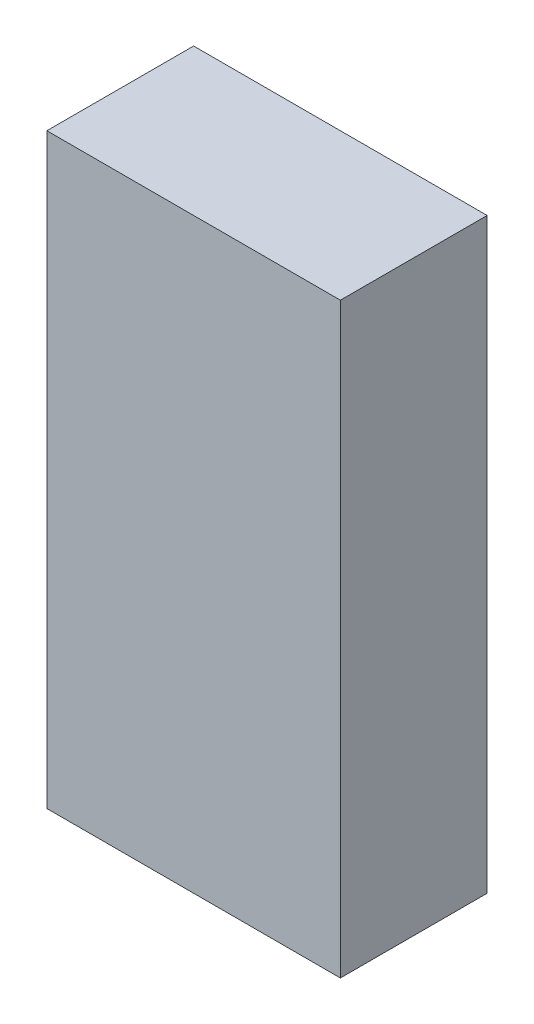
ISO-10303-21;
HEADER;
FILE_DESCRIPTION(('STEP AP214'),'2;1');
FILE_NAME('part.step','',(''),(''),'','','');
FILE_SCHEMA(('AUTOMOTIVE_DESIGN { 1 0 10303 214 1 1 1 1 }'));
ENDSEC;
DATA;
#1=APPLICATION_CONTEXT('core data for automotive mechanical design processes');
#2=APPLICATION_PROTOCOL_DEFINITION('international standard','automotive_design',2000,#1);
#3=PRODUCT_CONTEXT('',#1,'mechanical');
#4=PRODUCT('Part','Part','',(#3));
#5=PRODUCT_RELATED_PRODUCT_CATEGORY('part','',(#4));
#6=PRODUCT_DEFINITION_FORMATION('','',#4);
#7=PRODUCT_DEFINITION_CONTEXT('part definition',#1,'design');
#8=PRODUCT_DEFINITION('design','',#6,#7);
#9=PRODUCT_DEFINITION_SHAPE('','',#8);
#10=(LENGTH_UNIT() NAMED_UNIT(*) SI_UNIT(.MILLI.,.METRE.));
#11=(NAMED_UNIT(*) PLANE_ANGLE_UNIT() SI_UNIT($,.RADIAN.));
#12=(NAMED_UNIT(*) SI_UNIT($,.STERADIAN.) SOLID_ANGLE_UNIT());
#13=UNCERTAINTY_MEASURE_WITH_UNIT(LENGTH_MEASURE(1.E-05),#10,'distance_accuracy_value','');
#14=(GEOMETRIC_REPRESENTATION_CONTEXT(3) GLOBAL_UNCERTAINTY_ASSIGNED_CONTEXT((#13)) GLOBAL_UNIT_ASSIGNED_CONTEXT((#10,
#11,#12)) REPRESENTATION_CONTEXT('',''));
#15=CARTESIAN_POINT('',(0.,0.,0.));
#16=DIRECTION('',(0.,0.,1.));
#17=DIRECTION('',(1.,0.,0.));
#18=AXIS2_PLACEMENT_3D('',#15,#16,#17);
#19=CARTESIAN_POINT('',(0.50000154,-0.999998,0.499999));
#20=DIRECTION('',(0.,0.,-1.));
#21=DIRECTION('',(-1.,0.,0.));
#22=AXIS2_PLACEMENT_3D('',#19,#20,#21);
#23=PLANE('',#22);
#24=DIRECTION('',(1.,0.,0.));
#25=VECTOR('',#24,1.);
#26=CARTESIAN_POINT('',(0.50000154,1.00000054,0.499999));
#27=LINE('',#26,#25);
#28=CARTESIAN_POINT('',(0.50000154,1.00000054,0.499999));
#29=VERTEX_POINT('',#28);
#30=CARTESIAN_POINT('',(-0.499999,1.00000054,0.499999));
#31=VERTEX_POINT('',#30);
#32=EDGE_CURVE('E55',#29,#31,#27,.F.);
#33=ORIENTED_EDGE('',*,*,#32,.T.);
#34=DIRECTION('',(0.,1.,0.));
#35=VECTOR('',#34,1.);
#36=CARTESIAN_POINT('',(-0.499999,1.00000054,0.499999));
#37=LINE('',#36,#35);
#38=CARTESIAN_POINT('',(-0.499999,-0.999998,0.499999));
#39=VERTEX_POINT('',#38);
#40=EDGE_CURVE('E57',#31,#39,#37,.F.);
#41=ORIENTED_EDGE('',*,*,#40,.T.);
#42=DIRECTION('',(1.,0.,0.));
#43=VECTOR('',#42,1.);
#44=CARTESIAN_POINT('',(-0.499999,-0.999998,0.499999));
#45=LINE('',#44,#43);
#46=CARTESIAN_POINT('',(0.50000154,-0.999998,0.499999));
#47=VERTEX_POINT('',#46);
#48=EDGE_CURVE('E20',#39,#47,#45,.T.);
#49=ORIENTED_EDGE('',*,*,#48,.T.);
#50=DIRECTION('',(0.,1.,0.));
#51=VECTOR('',#50,1.);
#52=CARTESIAN_POINT('',(0.50000154,-0.999998,0.499999));
#53=LINE('',#52,#51);
#54=EDGE_CURVE('E80',#47,#29,#53,.T.);
#55=ORIENTED_EDGE('',*,*,#54,.T.);
#56=EDGE_LOOP('',(#33,#41,#49,#55));
#57=FACE_BOUND('',#56,.T.);
#58=ADVANCED_FACE('F17',(#57),#23,.F.);
#59=CARTESIAN_POINT('',(-0.499999,-0.999998,0.));
#60=DIRECTION('',(0.,1.,0.));
#61=DIRECTION('',(0.,0.,1.));
#62=AXIS2_PLACEMENT_3D('',#59,#60,#61);
#63=PLANE('',#62);
#64=DIRECTION('',(0.,0.,1.));
#65=VECTOR('',#64,1.);
#66=CARTESIAN_POINT('',(0.50000154,-0.999998,0.));
#67=LINE('',#66,#65);
#68=CARTESIAN_POINT('',(0.50000154,-0.999998,0.));
#69=VERTEX_POINT('',#68);
#70=EDGE_CURVE('E68',#69,#47,#67,.T.);
#71=ORIENTED_EDGE('',*,*,#70,.T.);
#72=ORIENTED_EDGE('',*,*,#48,.F.);
#73=DIRECTION('',(0.,0.,-1.));
#74=VECTOR('',#73,1.);
#75=CARTESIAN_POINT('',(-0.499999,-0.999998,0.));
#76=LINE('',#75,#74);
#77=CARTESIAN_POINT('',(-0.499999,-0.999998,0.));
#78=VERTEX_POINT('',#77);
#79=EDGE_CURVE('E63',#39,#78,#76,.T.);
#80=ORIENTED_EDGE('',*,*,#79,.T.);
#81=DIRECTION('',(-1.,0.,0.));
#82=VECTOR('',#81,1.);
#83=CARTESIAN_POINT('',(0.50000154,-0.999998,0.));
#84=LINE('',#83,#82);
#85=EDGE_CURVE('E83',#69,#78,#84,.T.);
#86=ORIENTED_EDGE('',*,*,#85,.F.);
#87=EDGE_LOOP('',(#71,#72,#80,#86));
#88=FACE_BOUND('',#87,.T.);
#89=ADVANCED_FACE('F65',(#88),#63,.F.);
#90=CARTESIAN_POINT('',(-0.499999,1.00000054,0.));
#91=DIRECTION('',(1.,0.,0.));
#92=DIRECTION('',(0.,0.,-1.));
#93=AXIS2_PLACEMENT_3D('',#90,#91,#92);
#94=PLANE('',#93);
#95=ORIENTED_EDGE('',*,*,#79,.F.);
#96=ORIENTED_EDGE('',*,*,#40,.F.);
#97=DIRECTION('',(0.,0.,-1.));
#98=VECTOR('',#97,1.);
#99=CARTESIAN_POINT('',(-0.499999,1.00000054,0.));
#100=LINE('',#99,#98);
#101=CARTESIAN_POINT('',(-0.499999,1.00000054,0.));
#102=VERTEX_POINT('',#101);
#103=EDGE_CURVE('E75',#31,#102,#100,.T.);
#104=ORIENTED_EDGE('',*,*,#103,.T.);
#105=DIRECTION('',(0.,1.,0.));
#106=VECTOR('',#105,1.);
#107=CARTESIAN_POINT('',(-0.499999,-0.999998,0.));
#108=LINE('',#107,#106);
#109=EDGE_CURVE('E72',#78,#102,#108,.T.);
#110=ORIENTED_EDGE('',*,*,#109,.F.);
#111=EDGE_LOOP('',(#95,#96,#104,#110));
#112=FACE_BOUND('',#111,.T.);
#113=ADVANCED_FACE('F70',(#112),#94,.F.);
#114=CARTESIAN_POINT('',(0.50000154,1.00000054,0.));
#115=DIRECTION('',(0.,-1.,0.));
#116=DIRECTION('',(0.,0.,-1.));
#117=AXIS2_PLACEMENT_3D('',#114,#115,#116);
#118=PLANE('',#117);
#119=ORIENTED_EDGE('',*,*,#103,.F.);
#120=ORIENTED_EDGE('',*,*,#32,.F.);
#121=DIRECTION('',(0.,0.,1.));
#122=VECTOR('',#121,1.);
#123=CARTESIAN_POINT('',(0.50000154,1.00000054,0.));
#124=LINE('',#123,#122);
#125=CARTESIAN_POINT('',(0.50000154,1.00000054,0.));
#126=VERTEX_POINT('',#125);
#127=EDGE_CURVE('E35',#29,#126,#124,.F.);
#128=ORIENTED_EDGE('',*,*,#127,.T.);
#129=DIRECTION('',(-1.,0.,0.));
#130=VECTOR('',#129,1.);
#131=CARTESIAN_POINT('',(0.50000154,1.00000054,0.));
#132=LINE('',#131,#130);
#133=EDGE_CURVE('E26',#102,#126,#132,.F.);
#134=ORIENTED_EDGE('',*,*,#133,.F.);
#135=EDGE_LOOP('',(#119,#120,#128,#134));
#136=FACE_BOUND('',#135,.T.);
#137=ADVANCED_FACE('F89',(#136),#118,.F.);
#138=CARTESIAN_POINT('',(0.50000154,-0.999998,0.));
#139=DIRECTION('',(-1.,0.,0.));
#140=DIRECTION('',(0.,0.,1.));
#141=AXIS2_PLACEMENT_3D('',#138,#139,#140);
#142=PLANE('',#141);
#143=ORIENTED_EDGE('',*,*,#127,.F.);
#144=ORIENTED_EDGE('',*,*,#54,.F.);
#145=ORIENTED_EDGE('',*,*,#70,.F.);
#146=DIRECTION('',(0.,1.,0.));
#147=VECTOR('',#146,1.);
#148=CARTESIAN_POINT('',(0.50000154,-0.999998,0.));
#149=LINE('',#148,#147);
#150=EDGE_CURVE('E11',#126,#69,#149,.F.);
#151=ORIENTED_EDGE('',*,*,#150,.F.);
#152=EDGE_LOOP('',(#143,#144,#145,#151));
#153=FACE_BOUND('',#152,.T.);
#154=ADVANCED_FACE('F91',(#153),#142,.F.);
#155=CARTESIAN_POINT('',(0.50000154,-0.999998,0.));
#156=DIRECTION('',(0.,0.,-1.));
#157=DIRECTION('',(-1.,0.,0.));
#158=AXIS2_PLACEMENT_3D('',#155,#156,#157);
#159=PLANE('',#158);
#160=ORIENTED_EDGE('',*,*,#133,.T.);
#161=ORIENTED_EDGE('',*,*,#150,.T.);
#162=ORIENTED_EDGE('',*,*,#85,.T.);
#163=ORIENTED_EDGE('',*,*,#109,.T.);
#164=EDGE_LOOP('',(#160,#161,#162,#163));
#165=FACE_BOUND('',#164,.T.);
#166=ADVANCED_FACE('F88',(#165),#159,.T.);
#167=CLOSED_SHELL('',(#58,#89,#113,#137,#154,#166));
#168=MANIFOLD_SOLID_BREP('B1',#167);
#169=ADVANCED_BREP_SHAPE_REPRESENTATION('',(#18,#168),#14);
#170=SHAPE_DEFINITION_REPRESENTATION(#9,#169);
ENDSEC;
END-ISO-10303-21;
